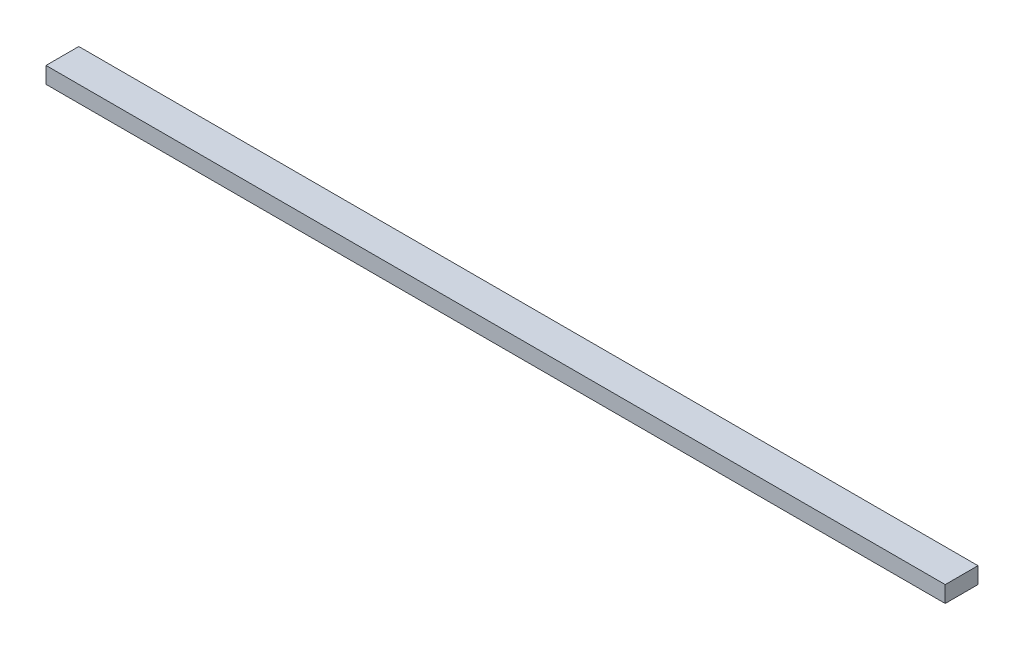
ISO-10303-21;
HEADER;
FILE_DESCRIPTION(('STEP AP214'),'2;1');
FILE_NAME('part.step','',(''),(''),'','','');
FILE_SCHEMA(('AUTOMOTIVE_DESIGN { 1 0 10303 214 1 1 1 1 }'));
ENDSEC;
DATA;
#1=APPLICATION_CONTEXT('core data for automotive mechanical design processes');
#2=APPLICATION_PROTOCOL_DEFINITION('international standard','automotive_design',2000,#1);
#3=PRODUCT_CONTEXT('',#1,'mechanical');
#4=PRODUCT('Part','Part','',(#3));
#5=PRODUCT_RELATED_PRODUCT_CATEGORY('part','',(#4));
#6=PRODUCT_DEFINITION_FORMATION('','',#4);
#7=PRODUCT_DEFINITION_CONTEXT('part definition',#1,'design');
#8=PRODUCT_DEFINITION('design','',#6,#7);
#9=PRODUCT_DEFINITION_SHAPE('','',#8);
#10=(LENGTH_UNIT() NAMED_UNIT(*) SI_UNIT(.MILLI.,.METRE.));
#11=(NAMED_UNIT(*) PLANE_ANGLE_UNIT() SI_UNIT($,.RADIAN.));
#12=(NAMED_UNIT(*) SI_UNIT($,.STERADIAN.) SOLID_ANGLE_UNIT());
#13=UNCERTAINTY_MEASURE_WITH_UNIT(LENGTH_MEASURE(1.E-05),#10,'distance_accuracy_value','');
#14=(GEOMETRIC_REPRESENTATION_CONTEXT(3) GLOBAL_UNCERTAINTY_ASSIGNED_CONTEXT((#13)) GLOBAL_UNIT_ASSIGNED_CONTEXT((#10,
#11,#12)) REPRESENTATION_CONTEXT('',''));
#15=CARTESIAN_POINT('',(0.,0.,0.));
#16=DIRECTION('',(0.,0.,1.));
#17=DIRECTION('',(1.,0.,0.));
#18=AXIS2_PLACEMENT_3D('',#15,#16,#17);
#19=CARTESIAN_POINT('',(-274.265,10.,-9.99999999999998));
#20=DIRECTION('',(1.,0.,0.));
#21=DIRECTION('',(0.,0.,-1.));
#22=AXIS2_PLACEMENT_3D('',#19,#20,#21);
#23=PLANE('',#22);
#24=DIRECTION('',(0.,0.,1.));
#25=VECTOR('',#24,1.);
#26=CARTESIAN_POINT('',(-274.265,0.,-9.99999999999998));
#27=LINE('',#26,#25);
#28=CARTESIAN_POINT('',(-274.265,0.,-9.99999999999998));
#29=VERTEX_POINT('',#28);
#30=CARTESIAN_POINT('',(-274.265,0.,10.));
#31=VERTEX_POINT('',#30);
#32=EDGE_CURVE('E97',#29,#31,#27,.T.);
#33=ORIENTED_EDGE('',*,*,#32,.T.);
#34=DIRECTION('',(0.,-1.,0.));
#35=VECTOR('',#34,1.);
#36=CARTESIAN_POINT('',(-274.265,10.,10.));
#37=LINE('',#36,#35);
#38=CARTESIAN_POINT('',(-274.265,10.,10.));
#39=VERTEX_POINT('',#38);
#40=EDGE_CURVE('E11',#39,#31,#37,.T.);
#41=ORIENTED_EDGE('',*,*,#40,.F.);
#42=DIRECTION('',(0.,0.,1.));
#43=VECTOR('',#42,1.);
#44=CARTESIAN_POINT('',(-274.265,10.,-9.99999999999998));
#45=LINE('',#44,#43);
#46=CARTESIAN_POINT('',(-274.265,10.,-9.99999999999998));
#47=VERTEX_POINT('',#46);
#48=EDGE_CURVE('E85',#47,#39,#45,.T.);
#49=ORIENTED_EDGE('',*,*,#48,.F.);
#50=DIRECTION('',(0.,-1.,0.));
#51=VECTOR('',#50,1.);
#52=CARTESIAN_POINT('',(-274.265,10.,-9.99999999999998));
#53=LINE('',#52,#51);
#54=EDGE_CURVE('E93',#47,#29,#53,.T.);
#55=ORIENTED_EDGE('',*,*,#54,.T.);
#56=EDGE_LOOP('',(#33,#41,#49,#55));
#57=FACE_BOUND('',#56,.T.);
#58=ADVANCED_FACE('F34',(#57),#23,.F.);
#59=CARTESIAN_POINT('',(-274.265,10.,10.));
#60=DIRECTION('',(0.,0.,-1.));
#61=DIRECTION('',(-1.,0.,0.));
#62=AXIS2_PLACEMENT_3D('',#59,#60,#61);
#63=PLANE('',#62);
#64=DIRECTION('',(1.,0.,0.));
#65=VECTOR('',#64,1.);
#66=CARTESIAN_POINT('',(-274.265,0.,10.));
#67=LINE('',#66,#65);
#68=CARTESIAN_POINT('',(274.265,0.,10.));
#69=VERTEX_POINT('',#68);
#70=EDGE_CURVE('E89',#31,#69,#67,.T.);
#71=ORIENTED_EDGE('',*,*,#70,.T.);
#72=DIRECTION('',(0.,-1.,0.));
#73=VECTOR('',#72,1.);
#74=CARTESIAN_POINT('',(274.265,10.,10.));
#75=LINE('',#74,#73);
#76=CARTESIAN_POINT('',(274.265,10.,10.));
#77=VERTEX_POINT('',#76);
#78=EDGE_CURVE('E42',#77,#69,#75,.T.);
#79=ORIENTED_EDGE('',*,*,#78,.F.);
#80=DIRECTION('',(1.,0.,0.));
#81=VECTOR('',#80,1.);
#82=CARTESIAN_POINT('',(-274.265,10.,10.));
#83=LINE('',#82,#81);
#84=EDGE_CURVE('E80',#39,#77,#83,.T.);
#85=ORIENTED_EDGE('',*,*,#84,.F.);
#86=ORIENTED_EDGE('',*,*,#40,.T.);
#87=EDGE_LOOP('',(#71,#79,#85,#86));
#88=FACE_BOUND('',#87,.T.);
#89=ADVANCED_FACE('F88',(#88),#63,.F.);
#90=CARTESIAN_POINT('',(274.265,10.,-9.99999999999998));
#91=DIRECTION('',(-1.,0.,0.));
#92=DIRECTION('',(0.,0.,1.));
#93=AXIS2_PLACEMENT_3D('',#90,#91,#92);
#94=PLANE('',#93);
#95=DIRECTION('',(0.,0.,-1.));
#96=VECTOR('',#95,1.);
#97=CARTESIAN_POINT('',(274.265,0.,-9.99999999999998));
#98=LINE('',#97,#96);
#99=CARTESIAN_POINT('',(274.265,0.,-9.99999999999998));
#100=VERTEX_POINT('',#99);
#101=EDGE_CURVE('E67',#69,#100,#98,.T.);
#102=ORIENTED_EDGE('',*,*,#101,.T.);
#103=DIRECTION('',(0.,-1.,0.));
#104=VECTOR('',#103,1.);
#105=CARTESIAN_POINT('',(274.265,10.,-9.99999999999998));
#106=LINE('',#105,#104);
#107=CARTESIAN_POINT('',(274.265,10.,-9.99999999999998));
#108=VERTEX_POINT('',#107);
#109=EDGE_CURVE('E90',#108,#100,#106,.T.);
#110=ORIENTED_EDGE('',*,*,#109,.F.);
#111=DIRECTION('',(0.,0.,-1.));
#112=VECTOR('',#111,1.);
#113=CARTESIAN_POINT('',(274.265,10.,-9.99999999999998));
#114=LINE('',#113,#112);
#115=EDGE_CURVE('E83',#77,#108,#114,.T.);
#116=ORIENTED_EDGE('',*,*,#115,.F.);
#117=ORIENTED_EDGE('',*,*,#78,.T.);
#118=EDGE_LOOP('',(#102,#110,#116,#117));
#119=FACE_BOUND('',#118,.T.);
#120=ADVANCED_FACE('F91',(#119),#94,.F.);
#121=CARTESIAN_POINT('',(-274.265,10.,-9.99999999999998));
#122=DIRECTION('',(0.,0.,1.));
#123=DIRECTION('',(1.,0.,0.));
#124=AXIS2_PLACEMENT_3D('',#121,#122,#123);
#125=PLANE('',#124);
#126=DIRECTION('',(-1.,0.,0.));
#127=VECTOR('',#126,1.);
#128=CARTESIAN_POINT('',(-274.265,0.,-9.99999999999998));
#129=LINE('',#128,#127);
#130=EDGE_CURVE('E73',#100,#29,#129,.T.);
#131=ORIENTED_EDGE('',*,*,#130,.T.);
#132=ORIENTED_EDGE('',*,*,#54,.F.);
#133=DIRECTION('',(-1.,0.,0.));
#134=VECTOR('',#133,1.);
#135=CARTESIAN_POINT('',(-274.265,10.,-9.99999999999998));
#136=LINE('',#135,#134);
#137=EDGE_CURVE('E50',#108,#47,#136,.T.);
#138=ORIENTED_EDGE('',*,*,#137,.F.);
#139=ORIENTED_EDGE('',*,*,#109,.T.);
#140=EDGE_LOOP('',(#131,#132,#138,#139));
#141=FACE_BOUND('',#140,.T.);
#142=ADVANCED_FACE('F104',(#141),#125,.F.);
#143=CARTESIAN_POINT('',(0.,10.,0.));
#144=DIRECTION('',(0.,1.,0.));
#145=DIRECTION('',(0.,0.,1.));
#146=AXIS2_PLACEMENT_3D('',#143,#144,#145);
#147=PLANE('',#146);
#148=ORIENTED_EDGE('',*,*,#48,.T.);
#149=ORIENTED_EDGE('',*,*,#84,.T.);
#150=ORIENTED_EDGE('',*,*,#115,.T.);
#151=ORIENTED_EDGE('',*,*,#137,.T.);
#152=EDGE_LOOP('',(#148,#149,#150,#151));
#153=FACE_BOUND('',#152,.T.);
#154=ADVANCED_FACE('F81',(#153),#147,.T.);
#155=CARTESIAN_POINT('',(0.,0.,0.));
#156=DIRECTION('',(0.,1.,0.));
#157=DIRECTION('',(0.,0.,1.));
#158=AXIS2_PLACEMENT_3D('',#155,#156,#157);
#159=PLANE('',#158);
#160=ORIENTED_EDGE('',*,*,#32,.F.);
#161=ORIENTED_EDGE('',*,*,#130,.F.);
#162=ORIENTED_EDGE('',*,*,#101,.F.);
#163=ORIENTED_EDGE('',*,*,#70,.F.);
#164=EDGE_LOOP('',(#160,#161,#162,#163));
#165=FACE_BOUND('',#164,.T.);
#166=ADVANCED_FACE('F107',(#165),#159,.F.);
#167=CLOSED_SHELL('',(#58,#89,#120,#142,#154,#166));
#168=MANIFOLD_SOLID_BREP('B2',#167);
#169=ADVANCED_BREP_SHAPE_REPRESENTATION('',(#18,#168),#14);
#170=SHAPE_DEFINITION_REPRESENTATION(#9,#169);
ENDSEC;
END-ISO-10303-21;
